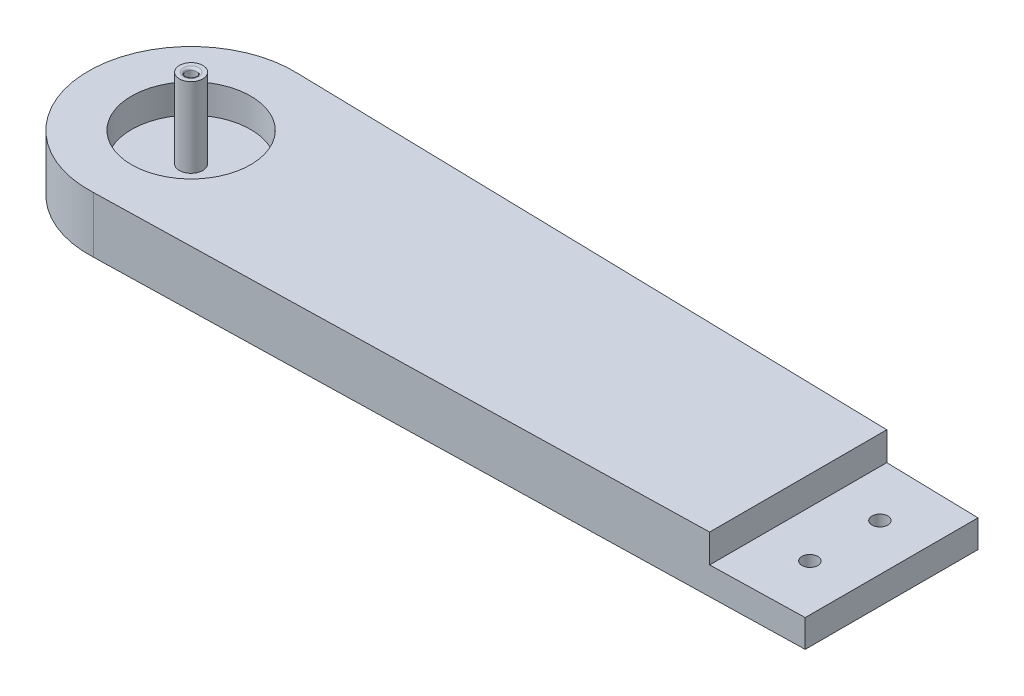
ISO-10303-21;
HEADER;
FILE_DESCRIPTION(('STEP AP214'),'2;1');
FILE_NAME('part.step','',(''),(''),'','','');
FILE_SCHEMA(('AUTOMOTIVE_DESIGN { 1 0 10303 214 1 1 1 1 }'));
ENDSEC;
DATA;
#1=APPLICATION_CONTEXT('core data for automotive mechanical design processes');
#2=APPLICATION_PROTOCOL_DEFINITION('international standard','automotive_design',2000,#1);
#3=PRODUCT_CONTEXT('',#1,'mechanical');
#4=PRODUCT('Part','Part','',(#3));
#5=PRODUCT_RELATED_PRODUCT_CATEGORY('part','',(#4));
#6=PRODUCT_DEFINITION_FORMATION('','',#4);
#7=PRODUCT_DEFINITION_CONTEXT('part definition',#1,'design');
#8=PRODUCT_DEFINITION('design','',#6,#7);
#9=PRODUCT_DEFINITION_SHAPE('','',#8);
#10=(LENGTH_UNIT() NAMED_UNIT(*) SI_UNIT(.MILLI.,.METRE.));
#11=(NAMED_UNIT(*) PLANE_ANGLE_UNIT() SI_UNIT($,.RADIAN.));
#12=(NAMED_UNIT(*) SI_UNIT($,.STERADIAN.) SOLID_ANGLE_UNIT());
#13=UNCERTAINTY_MEASURE_WITH_UNIT(LENGTH_MEASURE(1.E-05),#10,'distance_accuracy_value','');
#14=(GEOMETRIC_REPRESENTATION_CONTEXT(3) GLOBAL_UNCERTAINTY_ASSIGNED_CONTEXT((#13)) GLOBAL_UNIT_ASSIGNED_CONTEXT((#10,
#11,#12)) REPRESENTATION_CONTEXT('',''));
#15=CARTESIAN_POINT('',(0.,0.,0.));
#16=DIRECTION('',(0.,0.,1.));
#17=DIRECTION('',(1.,0.,0.));
#18=AXIS2_PLACEMENT_3D('',#15,#16,#17);
#19=CARTESIAN_POINT('',(140.,6.1,7.5));
#20=DIRECTION('',(0.,-1.,0.));
#21=DIRECTION('',(0.,0.,-1.));
#22=AXIS2_PLACEMENT_3D('',#19,#20,#21);
#23=CYLINDRICAL_SURFACE('',#22,1.70000000000001);
#24=CARTESIAN_POINT('',(140.,5.9,7.5));
#25=DIRECTION('',(0.,1.,0.));
#26=DIRECTION('',(0.,0.,1.));
#27=AXIS2_PLACEMENT_3D('',#24,#25,#26);
#28=CIRCLE('',#27,1.70000000000001);
#29=CARTESIAN_POINT('',(140.,5.9,9.20000000000001));
#30=VERTEX_POINT('',#29);
#31=EDGE_CURVE('E162',#30,#30,#28,.T.);
#32=ORIENTED_EDGE('',*,*,#31,.T.);
#33=EDGE_LOOP('',(#32));
#34=FACE_BOUND('',#33,.T.);
#35=CARTESIAN_POINT('',(140.,3.,7.5));
#36=DIRECTION('',(0.,-1.,0.));
#37=DIRECTION('',(0.,0.,-1.));
#38=AXIS2_PLACEMENT_3D('',#35,#36,#37);
#39=CIRCLE('',#38,1.70000000000001);
#40=CARTESIAN_POINT('',(140.,3.,5.79999999999999));
#41=VERTEX_POINT('',#40);
#42=EDGE_CURVE('E166',#41,#41,#39,.F.);
#43=ORIENTED_EDGE('',*,*,#42,.F.);
#44=EDGE_LOOP('',(#43));
#45=FACE_BOUND('',#44,.T.);
#46=ADVANCED_FACE('F41',(#34,#45),#23,.F.);
#47=CARTESIAN_POINT('',(140.,6.1,-7.5));
#48=DIRECTION('',(0.,-1.,0.));
#49=DIRECTION('',(0.,0.,-1.));
#50=AXIS2_PLACEMENT_3D('',#47,#48,#49);
#51=CYLINDRICAL_SURFACE('',#50,1.70000000000001);
#52=CARTESIAN_POINT('',(140.,5.9,-7.5));
#53=DIRECTION('',(0.,1.,0.));
#54=DIRECTION('',(0.,0.,1.));
#55=AXIS2_PLACEMENT_3D('',#52,#53,#54);
#56=CIRCLE('',#55,1.70000000000001);
#57=CARTESIAN_POINT('',(140.,5.9,-5.79999999999999));
#58=VERTEX_POINT('',#57);
#59=EDGE_CURVE('E165',#58,#58,#56,.F.);
#60=ORIENTED_EDGE('',*,*,#59,.F.);
#61=EDGE_LOOP('',(#60));
#62=FACE_BOUND('',#61,.T.);
#63=CARTESIAN_POINT('',(140.,3.,-7.5));
#64=DIRECTION('',(0.,-1.,0.));
#65=DIRECTION('',(0.,0.,-1.));
#66=AXIS2_PLACEMENT_3D('',#63,#64,#65);
#67=CIRCLE('',#66,1.70000000000001);
#68=CARTESIAN_POINT('',(140.,3.,-9.20000000000001));
#69=VERTEX_POINT('',#68);
#70=EDGE_CURVE('E170',#69,#69,#67,.T.);
#71=ORIENTED_EDGE('',*,*,#70,.T.);
#72=EDGE_LOOP('',(#71));
#73=FACE_BOUND('',#72,.T.);
#74=ADVANCED_FACE('F228',(#62,#73),#51,.F.);
#75=CARTESIAN_POINT('',(0.,0.,0.));
#76=DIRECTION('',(0.,1.,0.));
#77=DIRECTION('',(0.,0.,1.));
#78=AXIS2_PLACEMENT_3D('',#75,#76,#77);
#79=PLANE('',#78);
#80=CARTESIAN_POINT('',(140.,0.,-7.5));
#81=DIRECTION('',(0.,1.,0.));
#82=DIRECTION('',(0.,0.,1.));
#83=AXIS2_PLACEMENT_3D('',#80,#81,#82);
#84=CIRCLE('',#83,3.30000000000001);
#85=CARTESIAN_POINT('',(140.,0.,-4.2));
#86=VERTEX_POINT('',#85);
#87=EDGE_CURVE('E49',#86,#86,#84,.T.);
#88=ORIENTED_EDGE('',*,*,#87,.T.);
#89=EDGE_LOOP('',(#88));
#90=FACE_BOUND('',#89,.T.);
#91=CARTESIAN_POINT('',(140.,0.,7.5));
#92=DIRECTION('',(0.,1.,0.));
#93=DIRECTION('',(0.,0.,1.));
#94=AXIS2_PLACEMENT_3D('',#91,#92,#93);
#95=CIRCLE('',#94,3.30000000000001);
#96=CARTESIAN_POINT('',(140.,0.,10.8));
#97=VERTEX_POINT('',#96);
#98=EDGE_CURVE('E178',#97,#97,#95,.T.);
#99=ORIENTED_EDGE('',*,*,#98,.T.);
#100=EDGE_LOOP('',(#99));
#101=FACE_BOUND('',#100,.T.);
#102=CARTESIAN_POINT('',(0.,0.,0.));
#103=DIRECTION('',(0.,1.,0.));
#104=DIRECTION('',(0.,0.,1.));
#105=AXIS2_PLACEMENT_3D('',#102,#103,#104);
#106=CIRCLE('',#105,3.);
#107=CARTESIAN_POINT('',(0.,0.,3.));
#108=VERTEX_POINT('',#107);
#109=EDGE_CURVE('E152',#108,#108,#106,.T.);
#110=ORIENTED_EDGE('',*,*,#109,.T.);
#111=EDGE_LOOP('',(#110));
#112=FACE_BOUND('',#111,.T.);
#113=CARTESIAN_POINT('',(0.,0.,0.));
#114=DIRECTION('',(0.,1.,0.));
#115=DIRECTION('',(0.,0.,1.));
#116=AXIS2_PLACEMENT_3D('',#113,#114,#115);
#117=CIRCLE('',#116,22.);
#118=CARTESIAN_POINT('',(1.02610800786233,0.,-21.9760574798165));
#119=VERTEX_POINT('',#118);
#120=CARTESIAN_POINT('',(1.02610800786248,0.,21.9760574798165));
#121=VERTEX_POINT('',#120);
#122=EDGE_CURVE('E142',#119,#121,#117,.T.);
#123=ORIENTED_EDGE('',*,*,#122,.F.);
#124=DIRECTION('',(0.999727888884777,0.,0.0233269840739781));
#125=VECTOR('',#124,1.);
#126=CARTESIAN_POINT('',(0.513054003931193,0.,-21.9880287399083));
#127=LINE('',#126,#125);
#128=CARTESIAN_POINT('',(150.,0.,-18.5));
#129=VERTEX_POINT('',#128);
#130=EDGE_CURVE('E214',#119,#129,#127,.T.);
#131=ORIENTED_EDGE('',*,*,#130,.T.);
#132=DIRECTION('',(0.,0.,-1.));
#133=VECTOR('',#132,1.);
#134=CARTESIAN_POINT('',(150.,0.,0.));
#135=LINE('',#134,#133);
#136=CARTESIAN_POINT('',(150.,0.,18.5));
#137=VERTEX_POINT('',#136);
#138=EDGE_CURVE('E212',#137,#129,#135,.T.);
#139=ORIENTED_EDGE('',*,*,#138,.F.);
#140=DIRECTION('',(-0.999727888884777,0.,0.0233269840739781));
#141=VECTOR('',#140,1.);
#142=CARTESIAN_POINT('',(0.513054003931193,0.,21.9880287399083));
#143=LINE('',#142,#141);
#144=EDGE_CURVE('E117',#137,#121,#143,.T.);
#145=ORIENTED_EDGE('',*,*,#144,.T.);
#146=EDGE_LOOP('',(#123,#131,#139,#145));
#147=FACE_BOUND('',#146,.T.);
#148=ADVANCED_FACE('F183',(#90,#101,#112,#147),#79,.F.);
#149=CARTESIAN_POINT('',(0.,5.9,0.));
#150=DIRECTION('',(0.,1.,0.));
#151=DIRECTION('',(0.,0.,1.));
#152=AXIS2_PLACEMENT_3D('',#149,#150,#151);
#153=PLANE('',#152);
#154=DIRECTION('',(0.,0.,1.));
#155=VECTOR('',#154,1.);
#156=CARTESIAN_POINT('',(130.,5.9,0.));
#157=LINE('',#156,#155);
#158=CARTESIAN_POINT('',(130.,5.9,-18.9666666666667));
#159=VERTEX_POINT('',#158);
#160=CARTESIAN_POINT('',(130.,5.9,18.9666666666667));
#161=VERTEX_POINT('',#160);
#162=EDGE_CURVE('E56',#159,#161,#157,.T.);
#163=ORIENTED_EDGE('',*,*,#162,.T.);
#164=DIRECTION('',(0.999727888884777,0.,-0.0233269840739781));
#165=VECTOR('',#164,1.);
#166=CARTESIAN_POINT('',(0.513054003931193,5.9,21.9880287399083));
#167=LINE('',#166,#165);
#168=CARTESIAN_POINT('',(150.,5.9,18.5));
#169=VERTEX_POINT('',#168);
#170=EDGE_CURVE('E94',#161,#169,#167,.T.);
#171=ORIENTED_EDGE('',*,*,#170,.T.);
#172=DIRECTION('',(0.,0.,-1.));
#173=VECTOR('',#172,1.);
#174=CARTESIAN_POINT('',(150.,5.9,0.));
#175=LINE('',#174,#173);
#176=CARTESIAN_POINT('',(150.,5.9,-18.5));
#177=VERTEX_POINT('',#176);
#178=EDGE_CURVE('E98',#169,#177,#175,.T.);
#179=ORIENTED_EDGE('',*,*,#178,.T.);
#180=DIRECTION('',(-0.999727888884777,0.,-0.0233269840739781));
#181=VECTOR('',#180,1.);
#182=CARTESIAN_POINT('',(0.513054003931193,5.9,-21.9880287399083));
#183=LINE('',#182,#181);
#184=EDGE_CURVE('E111',#177,#159,#183,.T.);
#185=ORIENTED_EDGE('',*,*,#184,.T.);
#186=EDGE_LOOP('',(#163,#171,#179,#185));
#187=FACE_BOUND('',#186,.T.);
#188=ORIENTED_EDGE('',*,*,#31,.F.);
#189=EDGE_LOOP('',(#188));
#190=FACE_BOUND('',#189,.T.);
#191=ORIENTED_EDGE('',*,*,#59,.T.);
#192=EDGE_LOOP('',(#191));
#193=FACE_BOUND('',#192,.T.);
#194=ADVANCED_FACE('F96',(#187,#190,#193),#153,.T.);
#195=CARTESIAN_POINT('',(150.,12.,0.));
#196=DIRECTION('',(-1.,0.,0.));
#197=DIRECTION('',(0.,0.,1.));
#198=AXIS2_PLACEMENT_3D('',#195,#196,#197);
#199=PLANE('',#198);
#200=ORIENTED_EDGE('',*,*,#178,.F.);
#201=DIRECTION('',(0.,-1.,0.));
#202=VECTOR('',#201,1.);
#203=CARTESIAN_POINT('',(150.,12.,18.5));
#204=LINE('',#203,#202);
#205=EDGE_CURVE('E108',#169,#137,#204,.T.);
#206=ORIENTED_EDGE('',*,*,#205,.T.);
#207=ORIENTED_EDGE('',*,*,#138,.T.);
#208=DIRECTION('',(0.,-1.,0.));
#209=VECTOR('',#208,1.);
#210=CARTESIAN_POINT('',(150.,12.,-18.5));
#211=LINE('',#210,#209);
#212=EDGE_CURVE('E110',#177,#129,#211,.T.);
#213=ORIENTED_EDGE('',*,*,#212,.F.);
#214=EDGE_LOOP('',(#200,#206,#207,#213));
#215=FACE_BOUND('',#214,.T.);
#216=ADVANCED_FACE('F106',(#215),#199,.F.);
#217=CARTESIAN_POINT('',(0.,34.1,0.));
#218=DIRECTION('',(0.,-1.,0.));
#219=DIRECTION('',(0.,0.,-1.));
#220=AXIS2_PLACEMENT_3D('',#217,#218,#219);
#221=CYLINDRICAL_SURFACE('',#220,1.15);
#222=CARTESIAN_POINT('',(0.,22.3,0.));
#223=DIRECTION('',(0.,1.,0.));
#224=DIRECTION('',(0.,0.,1.));
#225=AXIS2_PLACEMENT_3D('',#222,#223,#224);
#226=CIRCLE('',#225,1.15);
#227=CARTESIAN_POINT('',(0.,22.3,1.15));
#228=VERTEX_POINT('',#227);
#229=EDGE_CURVE('E155',#228,#228,#226,.T.);
#230=ORIENTED_EDGE('',*,*,#229,.T.);
#231=EDGE_LOOP('',(#230));
#232=FACE_BOUND('',#231,.T.);
#233=CARTESIAN_POINT('',(0.,20.,0.));
#234=DIRECTION('',(0.,-1.,0.));
#235=DIRECTION('',(0.,0.,-1.));
#236=AXIS2_PLACEMENT_3D('',#233,#234,#235);
#237=CIRCLE('',#236,1.15);
#238=CARTESIAN_POINT('',(0.,20.,-1.15));
#239=VERTEX_POINT('',#238);
#240=EDGE_CURVE('E131',#239,#239,#237,.F.);
#241=ORIENTED_EDGE('',*,*,#240,.F.);
#242=EDGE_LOOP('',(#241));
#243=FACE_BOUND('',#242,.T.);
#244=ADVANCED_FACE('F257',(#232,#243),#221,.F.);
#245=CARTESIAN_POINT('',(0.,12.,0.));
#246=DIRECTION('',(0.,-1.,0.));
#247=DIRECTION('',(0.,0.,-1.));
#248=AXIS2_PLACEMENT_3D('',#245,#246,#247);
#249=CYLINDRICAL_SURFACE('',#248,22.);
#250=CARTESIAN_POINT('',(0.,12.,0.));
#251=DIRECTION('',(0.,1.,0.));
#252=DIRECTION('',(0.,0.,1.));
#253=AXIS2_PLACEMENT_3D('',#250,#251,#252);
#254=CIRCLE('',#253,22.);
#255=CARTESIAN_POINT('',(1.02610800786233,12.,-21.9760574798165));
#256=VERTEX_POINT('',#255);
#257=CARTESIAN_POINT('',(1.02610800786248,12.,21.9760574798165));
#258=VERTEX_POINT('',#257);
#259=EDGE_CURVE('E64',#256,#258,#254,.T.);
#260=ORIENTED_EDGE('',*,*,#259,.F.);
#261=DIRECTION('',(0.,-1.,0.));
#262=VECTOR('',#261,1.);
#263=CARTESIAN_POINT('',(1.02610800786233,12.,-21.9760574798165));
#264=LINE('',#263,#262);
#265=EDGE_CURVE('E121',#256,#119,#264,.T.);
#266=ORIENTED_EDGE('',*,*,#265,.T.);
#267=ORIENTED_EDGE('',*,*,#122,.T.);
#268=DIRECTION('',(0.,-1.,0.));
#269=VECTOR('',#268,1.);
#270=CARTESIAN_POINT('',(1.02610800786248,12.,21.9760574798165));
#271=LINE('',#270,#269);
#272=EDGE_CURVE('E118',#258,#121,#271,.T.);
#273=ORIENTED_EDGE('',*,*,#272,.F.);
#274=EDGE_LOOP('',(#260,#266,#267,#273));
#275=FACE_BOUND('',#274,.T.);
#276=ADVANCED_FACE('F221',(#275),#249,.T.);
#277=CARTESIAN_POINT('',(0.,12.,0.));
#278=DIRECTION('',(0.,1.,0.));
#279=DIRECTION('',(0.,0.,1.));
#280=AXIS2_PLACEMENT_3D('',#277,#278,#279);
#281=PLANE('',#280);
#282=DIRECTION('',(0.,0.,1.));
#283=VECTOR('',#282,1.);
#284=CARTESIAN_POINT('',(130.,12.,0.));
#285=LINE('',#284,#283);
#286=CARTESIAN_POINT('',(130.,12.,-18.9666666666667));
#287=VERTEX_POINT('',#286);
#288=CARTESIAN_POINT('',(130.,12.,18.9666666666667));
#289=VERTEX_POINT('',#288);
#290=EDGE_CURVE('E169',#287,#289,#285,.T.);
#291=ORIENTED_EDGE('',*,*,#290,.F.);
#292=DIRECTION('',(0.999727888884777,0.,0.0233269840739781));
#293=VECTOR('',#292,1.);
#294=CARTESIAN_POINT('',(0.513054003931193,12.,-21.9880287399083));
#295=LINE('',#294,#293);
#296=EDGE_CURVE('E119',#256,#287,#295,.T.);
#297=ORIENTED_EDGE('',*,*,#296,.F.);
#298=ORIENTED_EDGE('',*,*,#259,.T.);
#299=DIRECTION('',(-0.999727888884777,0.,0.0233269840739781));
#300=VECTOR('',#299,1.);
#301=CARTESIAN_POINT('',(0.513054003931193,12.,21.9880287399083));
#302=LINE('',#301,#300);
#303=EDGE_CURVE('E124',#289,#258,#302,.T.);
#304=ORIENTED_EDGE('',*,*,#303,.F.);
#305=EDGE_LOOP('',(#291,#297,#298,#304));
#306=FACE_BOUND('',#305,.T.);
#307=CARTESIAN_POINT('',(0.,12.,0.));
#308=DIRECTION('',(0.,1.,0.));
#309=DIRECTION('',(0.,0.,1.));
#310=AXIS2_PLACEMENT_3D('',#307,#308,#309);
#311=CIRCLE('',#310,12.75);
#312=CARTESIAN_POINT('',(0.,12.,12.75));
#313=VERTEX_POINT('',#312);
#314=EDGE_CURVE('E135',#313,#313,#311,.T.);
#315=ORIENTED_EDGE('',*,*,#314,.F.);
#316=EDGE_LOOP('',(#315));
#317=FACE_BOUND('',#316,.T.);
#318=ADVANCED_FACE('F284',(#306,#317),#281,.T.);
#319=CARTESIAN_POINT('',(0.,5.8,0.));
#320=DIRECTION('',(0.,1.,0.));
#321=DIRECTION('',(0.,0.,1.));
#322=AXIS2_PLACEMENT_3D('',#319,#320,#321);
#323=CYLINDRICAL_SURFACE('',#322,12.75);
#324=CARTESIAN_POINT('',(0.,5.8,0.));
#325=DIRECTION('',(0.,1.,0.));
#326=DIRECTION('',(0.,0.,1.));
#327=AXIS2_PLACEMENT_3D('',#324,#325,#326);
#328=CIRCLE('',#327,12.75);
#329=CARTESIAN_POINT('',(0.,5.8,12.75));
#330=VERTEX_POINT('',#329);
#331=EDGE_CURVE('E139',#330,#330,#328,.T.);
#332=ORIENTED_EDGE('',*,*,#331,.F.);
#333=EDGE_LOOP('',(#332));
#334=FACE_BOUND('',#333,.T.);
#335=ORIENTED_EDGE('',*,*,#314,.T.);
#336=EDGE_LOOP('',(#335));
#337=FACE_BOUND('',#336,.T.);
#338=ADVANCED_FACE('F281',(#334,#337),#323,.F.);
#339=CARTESIAN_POINT('',(0.,5.8,0.));
#340=DIRECTION('',(0.,1.,0.));
#341=DIRECTION('',(0.,0.,1.));
#342=AXIS2_PLACEMENT_3D('',#339,#340,#341);
#343=PLANE('',#342);
#344=CARTESIAN_POINT('',(0.,5.8,0.));
#345=DIRECTION('',(0.,1.,0.));
#346=DIRECTION('',(0.,0.,1.));
#347=AXIS2_PLACEMENT_3D('',#344,#345,#346);
#348=CIRCLE('',#347,2.5);
#349=CARTESIAN_POINT('',(0.,5.8,2.5));
#350=VERTEX_POINT('',#349);
#351=EDGE_CURVE('E136',#350,#350,#348,.T.);
#352=ORIENTED_EDGE('',*,*,#351,.F.);
#353=EDGE_LOOP('',(#352));
#354=FACE_BOUND('',#353,.T.);
#355=ORIENTED_EDGE('',*,*,#331,.T.);
#356=EDGE_LOOP('',(#355));
#357=FACE_BOUND('',#356,.T.);
#358=ADVANCED_FACE('F277',(#354,#357),#343,.T.);
#359=CARTESIAN_POINT('',(0.,22.8,0.));
#360=DIRECTION('',(0.,-1.,0.));
#361=DIRECTION('',(0.,0.,-1.));
#362=AXIS2_PLACEMENT_3D('',#359,#360,#361);
#363=CYLINDRICAL_SURFACE('',#362,2.5);
#364=CARTESIAN_POINT('',(0.,22.8,0.));
#365=DIRECTION('',(0.,1.,0.));
#366=DIRECTION('',(0.,0.,1.));
#367=AXIS2_PLACEMENT_3D('',#364,#365,#366);
#368=CIRCLE('',#367,2.5);
#369=CARTESIAN_POINT('',(0.,22.8,2.5));
#370=VERTEX_POINT('',#369);
#371=EDGE_CURVE('E132',#370,#370,#368,.T.);
#372=ORIENTED_EDGE('',*,*,#371,.F.);
#373=EDGE_LOOP('',(#372));
#374=FACE_BOUND('',#373,.T.);
#375=ORIENTED_EDGE('',*,*,#351,.T.);
#376=EDGE_LOOP('',(#375));
#377=FACE_BOUND('',#376,.T.);
#378=ADVANCED_FACE('F273',(#374,#377),#363,.T.);
#379=CARTESIAN_POINT('',(0.,22.8,0.));
#380=DIRECTION('',(0.,1.,0.));
#381=DIRECTION('',(0.,0.,1.));
#382=AXIS2_PLACEMENT_3D('',#379,#380,#381);
#383=PLANE('',#382);
#384=CARTESIAN_POINT('',(0.,22.8,0.));
#385=DIRECTION('',(0.,1.,0.));
#386=DIRECTION('',(0.,0.,1.));
#387=AXIS2_PLACEMENT_3D('',#384,#385,#386);
#388=CIRCLE('',#387,1.65);
#389=CARTESIAN_POINT('',(0.,22.8,1.65));
#390=VERTEX_POINT('',#389);
#391=EDGE_CURVE('E158',#390,#390,#388,.F.);
#392=ORIENTED_EDGE('',*,*,#391,.T.);
#393=EDGE_LOOP('',(#392));
#394=FACE_BOUND('',#393,.T.);
#395=ORIENTED_EDGE('',*,*,#371,.T.);
#396=EDGE_LOOP('',(#395));
#397=FACE_BOUND('',#396,.T.);
#398=ADVANCED_FACE('F262',(#394,#397),#383,.T.);
#399=CARTESIAN_POINT('',(0.,20.,0.));
#400=DIRECTION('',(0.,-1.,0.));
#401=DIRECTION('',(0.,0.,-1.));
#402=AXIS2_PLACEMENT_3D('',#399,#400,#401);
#403=PLANE('',#402);
#404=CARTESIAN_POINT('',(0.,20.,0.));
#405=DIRECTION('',(0.,-1.,0.));
#406=DIRECTION('',(0.,0.,-1.));
#407=AXIS2_PLACEMENT_3D('',#404,#405,#406);
#408=CIRCLE('',#407,2.);
#409=CARTESIAN_POINT('',(0.,20.,-2.));
#410=VERTEX_POINT('',#409);
#411=EDGE_CURVE('E128',#410,#410,#408,.T.);
#412=ORIENTED_EDGE('',*,*,#411,.T.);
#413=EDGE_LOOP('',(#412));
#414=FACE_BOUND('',#413,.T.);
#415=ORIENTED_EDGE('',*,*,#240,.T.);
#416=EDGE_LOOP('',(#415));
#417=FACE_BOUND('',#416,.T.);
#418=ADVANCED_FACE('F258',(#414,#417),#403,.T.);
#419=CARTESIAN_POINT('',(0.,20.,0.));
#420=DIRECTION('',(0.,-1.,0.));
#421=DIRECTION('',(0.,0.,-1.));
#422=AXIS2_PLACEMENT_3D('',#419,#420,#421);
#423=CYLINDRICAL_SURFACE('',#422,2.);
#424=CARTESIAN_POINT('',(0.,1.,0.));
#425=DIRECTION('',(0.,1.,0.));
#426=DIRECTION('',(0.,0.,1.));
#427=AXIS2_PLACEMENT_3D('',#424,#425,#426);
#428=CIRCLE('',#427,2.);
#429=CARTESIAN_POINT('',(0.,1.,2.));
#430=VERTEX_POINT('',#429);
#431=EDGE_CURVE('E146',#430,#430,#428,.F.);
#432=ORIENTED_EDGE('',*,*,#431,.T.);
#433=EDGE_LOOP('',(#432));
#434=FACE_BOUND('',#433,.T.);
#435=ORIENTED_EDGE('',*,*,#411,.F.);
#436=EDGE_LOOP('',(#435));
#437=FACE_BOUND('',#436,.T.);
#438=ADVANCED_FACE('F261',(#434,#437),#423,.F.);
#439=CARTESIAN_POINT('',(0.,1.,0.));
#440=DIRECTION('',(0.,1.,0.));
#441=DIRECTION('',(0.,0.,1.));
#442=AXIS2_PLACEMENT_3D('',#439,#440,#441);
#443=TOROIDAL_SURFACE('',#442,3.,1.);
#444=ORIENTED_EDGE('',*,*,#109,.F.);
#445=EDGE_LOOP('',(#444));
#446=FACE_BOUND('',#445,.T.);
#447=ORIENTED_EDGE('',*,*,#431,.F.);
#448=EDGE_LOOP('',(#447));
#449=FACE_BOUND('',#448,.T.);
#450=ADVANCED_FACE('F266',(#446,#449),#443,.T.);
#451=CARTESIAN_POINT('',(0.,22.3,0.));
#452=DIRECTION('',(0.,1.,0.));
#453=DIRECTION('',(0.,0.,1.));
#454=AXIS2_PLACEMENT_3D('',#451,#452,#453);
#455=TOROIDAL_SURFACE('',#454,1.65,0.5);
#456=ORIENTED_EDGE('',*,*,#391,.F.);
#457=EDGE_LOOP('',(#456));
#458=FACE_BOUND('',#457,.T.);
#459=ORIENTED_EDGE('',*,*,#229,.F.);
#460=EDGE_LOOP('',(#459));
#461=FACE_BOUND('',#460,.T.);
#462=ADVANCED_FACE('F252',(#458,#461),#455,.T.);
#463=CARTESIAN_POINT('',(0.513054003931193,12.,-21.9880287399083));
#464=DIRECTION('',(0.0233269840739781,0.,-0.999727888884777));
#465=DIRECTION('',(-0.999727888884777,0.,-0.0233269840739781));
#466=AXIS2_PLACEMENT_3D('',#463,#464,#465);
#467=PLANE('',#466);
#468=DIRECTION('',(0.,1.,0.));
#469=VECTOR('',#468,1.);
#470=CARTESIAN_POINT('',(130.,5.9,-18.9666666666667));
#471=LINE('',#470,#469);
#472=EDGE_CURVE('E210',#159,#287,#471,.T.);
#473=ORIENTED_EDGE('',*,*,#472,.F.);
#474=ORIENTED_EDGE('',*,*,#184,.F.);
#475=ORIENTED_EDGE('',*,*,#212,.T.);
#476=ORIENTED_EDGE('',*,*,#130,.F.);
#477=ORIENTED_EDGE('',*,*,#265,.F.);
#478=ORIENTED_EDGE('',*,*,#296,.T.);
#479=EDGE_LOOP('',(#473,#474,#475,#476,#477,#478));
#480=FACE_BOUND('',#479,.T.);
#481=ADVANCED_FACE('F225',(#480),#467,.T.);
#482=CARTESIAN_POINT('',(0.513054003931193,12.,21.9880287399083));
#483=DIRECTION('',(0.0233269840739781,0.,0.999727888884777));
#484=DIRECTION('',(0.999727888884777,0.,-0.0233269840739781));
#485=AXIS2_PLACEMENT_3D('',#482,#483,#484);
#486=PLANE('',#485);
#487=DIRECTION('',(0.,1.,0.));
#488=VECTOR('',#487,1.);
#489=CARTESIAN_POINT('',(130.,5.9,18.9666666666667));
#490=LINE('',#489,#488);
#491=EDGE_CURVE('E208',#161,#289,#490,.T.);
#492=ORIENTED_EDGE('',*,*,#491,.T.);
#493=ORIENTED_EDGE('',*,*,#303,.T.);
#494=ORIENTED_EDGE('',*,*,#272,.T.);
#495=ORIENTED_EDGE('',*,*,#144,.F.);
#496=ORIENTED_EDGE('',*,*,#205,.F.);
#497=ORIENTED_EDGE('',*,*,#170,.F.);
#498=EDGE_LOOP('',(#492,#493,#494,#495,#496,#497));
#499=FACE_BOUND('',#498,.T.);
#500=ADVANCED_FACE('F114',(#499),#486,.T.);
#501=CARTESIAN_POINT('',(130.,5.9,0.));
#502=DIRECTION('',(-1.,0.,0.));
#503=DIRECTION('',(0.,0.,1.));
#504=AXIS2_PLACEMENT_3D('',#501,#502,#503);
#505=PLANE('',#504);
#506=ORIENTED_EDGE('',*,*,#290,.T.);
#507=ORIENTED_EDGE('',*,*,#491,.F.);
#508=ORIENTED_EDGE('',*,*,#162,.F.);
#509=ORIENTED_EDGE('',*,*,#472,.T.);
#510=EDGE_LOOP('',(#506,#507,#508,#509));
#511=FACE_BOUND('',#510,.T.);
#512=ADVANCED_FACE('F196',(#511),#505,.F.);
#513=CARTESIAN_POINT('',(140.,3.,-7.5));
#514=DIRECTION('',(0.,-1.,0.));
#515=DIRECTION('',(0.,0.,-1.));
#516=AXIS2_PLACEMENT_3D('',#513,#514,#515);
#517=CYLINDRICAL_SURFACE('',#516,2.80000000000001);
#518=CARTESIAN_POINT('',(140.,0.5,-7.5));
#519=DIRECTION('',(0.,1.,0.));
#520=DIRECTION('',(0.,0.,1.));
#521=AXIS2_PLACEMENT_3D('',#518,#519,#520);
#522=CIRCLE('',#521,2.80000000000001);
#523=CARTESIAN_POINT('',(140.,0.5,-4.7));
#524=VERTEX_POINT('',#523);
#525=EDGE_CURVE('E161',#524,#524,#522,.F.);
#526=ORIENTED_EDGE('',*,*,#525,.T.);
#527=EDGE_LOOP('',(#526));
#528=FACE_BOUND('',#527,.T.);
#529=CARTESIAN_POINT('',(140.,3.,-7.5));
#530=DIRECTION('',(0.,-1.,0.));
#531=DIRECTION('',(0.,0.,-1.));
#532=AXIS2_PLACEMENT_3D('',#529,#530,#531);
#533=CIRCLE('',#532,2.80000000000001);
#534=CARTESIAN_POINT('',(140.,3.,-10.3));
#535=VERTEX_POINT('',#534);
#536=EDGE_CURVE('E200',#535,#535,#533,.T.);
#537=ORIENTED_EDGE('',*,*,#536,.F.);
#538=EDGE_LOOP('',(#537));
#539=FACE_BOUND('',#538,.T.);
#540=ADVANCED_FACE('F192',(#528,#539),#517,.F.);
#541=CARTESIAN_POINT('',(140.,3.,-7.5));
#542=DIRECTION('',(0.,-1.,0.));
#543=DIRECTION('',(0.,0.,-1.));
#544=AXIS2_PLACEMENT_3D('',#541,#542,#543);
#545=PLANE('',#544);
#546=ORIENTED_EDGE('',*,*,#70,.F.);
#547=EDGE_LOOP('',(#546));
#548=FACE_BOUND('',#547,.T.);
#549=ORIENTED_EDGE('',*,*,#536,.T.);
#550=EDGE_LOOP('',(#549));
#551=FACE_BOUND('',#550,.T.);
#552=ADVANCED_FACE('F195',(#548,#551),#545,.T.);
#553=CARTESIAN_POINT('',(140.,3.,7.5));
#554=DIRECTION('',(0.,-1.,0.));
#555=DIRECTION('',(0.,0.,-1.));
#556=AXIS2_PLACEMENT_3D('',#553,#554,#555);
#557=PLANE('',#556);
#558=CARTESIAN_POINT('',(140.,3.,7.5));
#559=DIRECTION('',(0.,-1.,0.));
#560=DIRECTION('',(0.,0.,-1.));
#561=AXIS2_PLACEMENT_3D('',#558,#559,#560);
#562=CIRCLE('',#561,2.80000000000001);
#563=CARTESIAN_POINT('',(140.,3.,4.69999999999999));
#564=VERTEX_POINT('',#563);
#565=EDGE_CURVE('E173',#564,#564,#562,.T.);
#566=ORIENTED_EDGE('',*,*,#565,.T.);
#567=EDGE_LOOP('',(#566));
#568=FACE_BOUND('',#567,.T.);
#569=ORIENTED_EDGE('',*,*,#42,.T.);
#570=EDGE_LOOP('',(#569));
#571=FACE_BOUND('',#570,.T.);
#572=ADVANCED_FACE('F345',(#568,#571),#557,.T.);
#573=CARTESIAN_POINT('',(140.,3.,7.5));
#574=DIRECTION('',(0.,-1.,0.));
#575=DIRECTION('',(0.,0.,-1.));
#576=AXIS2_PLACEMENT_3D('',#573,#574,#575);
#577=CYLINDRICAL_SURFACE('',#576,2.80000000000001);
#578=CARTESIAN_POINT('',(140.,0.5,7.5));
#579=DIRECTION('',(0.,1.,0.));
#580=DIRECTION('',(0.,0.,1.));
#581=AXIS2_PLACEMENT_3D('',#578,#579,#580);
#582=CIRCLE('',#581,2.80000000000001);
#583=CARTESIAN_POINT('',(140.,0.5,10.3));
#584=VERTEX_POINT('',#583);
#585=EDGE_CURVE('E11',#584,#584,#582,.F.);
#586=ORIENTED_EDGE('',*,*,#585,.T.);
#587=EDGE_LOOP('',(#586));
#588=FACE_BOUND('',#587,.T.);
#589=ORIENTED_EDGE('',*,*,#565,.F.);
#590=EDGE_LOOP('',(#589));
#591=FACE_BOUND('',#590,.T.);
#592=ADVANCED_FACE('F189',(#588,#591),#577,.F.);
#593=CARTESIAN_POINT('',(140.,0.5,-7.5));
#594=DIRECTION('',(0.,1.,0.));
#595=DIRECTION('',(0.,0.,1.));
#596=AXIS2_PLACEMENT_3D('',#593,#594,#595);
#597=TOROIDAL_SURFACE('',#596,3.30000000000001,0.5);
#598=ORIENTED_EDGE('',*,*,#87,.F.);
#599=EDGE_LOOP('',(#598));
#600=FACE_BOUND('',#599,.T.);
#601=ORIENTED_EDGE('',*,*,#525,.F.);
#602=EDGE_LOOP('',(#601));
#603=FACE_BOUND('',#602,.T.);
#604=ADVANCED_FACE('F186',(#600,#603),#597,.T.);
#605=CARTESIAN_POINT('',(140.,0.5,7.5));
#606=DIRECTION('',(0.,1.,0.));
#607=DIRECTION('',(0.,0.,1.));
#608=AXIS2_PLACEMENT_3D('',#605,#606,#607);
#609=TOROIDAL_SURFACE('',#608,3.30000000000001,0.5);
#610=ORIENTED_EDGE('',*,*,#98,.F.);
#611=EDGE_LOOP('',(#610));
#612=FACE_BOUND('',#611,.T.);
#613=ORIENTED_EDGE('',*,*,#585,.F.);
#614=EDGE_LOOP('',(#613));
#615=FACE_BOUND('',#614,.T.);
#616=ADVANCED_FACE('F43',(#612,#615),#609,.T.);
#617=CLOSED_SHELL('',(#46,#74,#148,#194,#216,#244,#276,#318,#338,#358,#378,#398,#418,#438,#450,
#462,#481,#500,#512,#540,#552,#572,#592,#604,#616));
#618=MANIFOLD_SOLID_BREP('B2',#617);
#619=ADVANCED_BREP_SHAPE_REPRESENTATION('',(#18,#618),#14);
#620=SHAPE_DEFINITION_REPRESENTATION(#9,#619);
ENDSEC;
END-ISO-10303-21;
